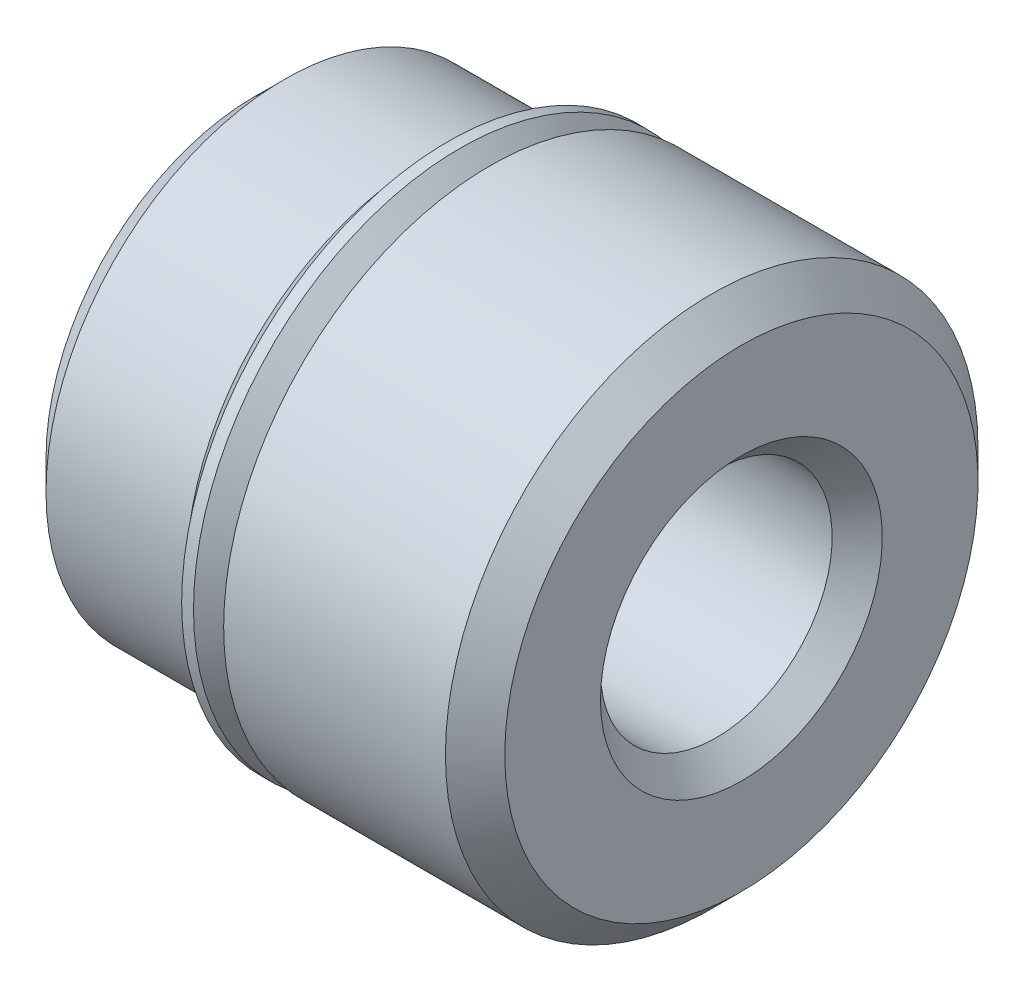
ISO-10303-21;
HEADER;
FILE_DESCRIPTION(('STEP AP214'),'2;1');
FILE_NAME('part.step','',(''),(''),'','','');
FILE_SCHEMA(('AUTOMOTIVE_DESIGN { 1 0 10303 214 1 1 1 1 }'));
ENDSEC;
DATA;
#1=APPLICATION_CONTEXT('core data for automotive mechanical design processes');
#2=APPLICATION_PROTOCOL_DEFINITION('international standard','automotive_design',2000,#1);
#3=PRODUCT_CONTEXT('',#1,'mechanical');
#4=PRODUCT('Part','Part','',(#3));
#5=PRODUCT_RELATED_PRODUCT_CATEGORY('part','',(#4));
#6=PRODUCT_DEFINITION_FORMATION('','',#4);
#7=PRODUCT_DEFINITION_CONTEXT('part definition',#1,'design');
#8=PRODUCT_DEFINITION('design','',#6,#7);
#9=PRODUCT_DEFINITION_SHAPE('','',#8);
#10=(LENGTH_UNIT() NAMED_UNIT(*) SI_UNIT(.MILLI.,.METRE.));
#11=(NAMED_UNIT(*) PLANE_ANGLE_UNIT() SI_UNIT($,.RADIAN.));
#12=(NAMED_UNIT(*) SI_UNIT($,.STERADIAN.) SOLID_ANGLE_UNIT());
#13=UNCERTAINTY_MEASURE_WITH_UNIT(LENGTH_MEASURE(1.E-05),#10,'distance_accuracy_value','');
#14=(GEOMETRIC_REPRESENTATION_CONTEXT(3) GLOBAL_UNCERTAINTY_ASSIGNED_CONTEXT((#13)) GLOBAL_UNIT_ASSIGNED_CONTEXT((#10,
#11,#12)) REPRESENTATION_CONTEXT('',''));
#15=CARTESIAN_POINT('',(0.,0.,0.));
#16=DIRECTION('',(0.,0.,1.));
#17=DIRECTION('',(1.,0.,0.));
#18=AXIS2_PLACEMENT_3D('',#15,#16,#17);
#19=CARTESIAN_POINT('',(8.3312,0.,0.));
#20=DIRECTION('',(-1.,0.,0.));
#21=DIRECTION('',(0.,0.,1.));
#22=AXIS2_PLACEMENT_3D('',#19,#20,#21);
#23=CYLINDRICAL_SURFACE('',#22,3.52425);
#24=CARTESIAN_POINT('',(3.4671,0.,0.));
#25=DIRECTION('',(-1.,0.,0.));
#26=DIRECTION('',(0.,0.,1.));
#27=AXIS2_PLACEMENT_3D('',#24,#25,#26);
#28=CIRCLE('',#27,3.52425);
#29=CARTESIAN_POINT('',(3.4671,0.,3.52425));
#30=VERTEX_POINT('',#29);
#31=EDGE_CURVE('E58',#30,#30,#28,.T.);
#32=ORIENTED_EDGE('',*,*,#31,.F.);
#33=EDGE_LOOP('',(#32));
#34=FACE_BOUND('',#33,.T.);
#35=CARTESIAN_POINT('',(3.7465000000001,0.,0.));
#36=DIRECTION('',(1.,0.,0.));
#37=DIRECTION('',(0.,0.,-1.));
#38=AXIS2_PLACEMENT_3D('',#35,#36,#37);
#39=CIRCLE('',#38,3.52425);
#40=CARTESIAN_POINT('',(3.7465000000001,0.,-3.52425));
#41=VERTEX_POINT('',#40);
#42=EDGE_CURVE('E10',#41,#41,#39,.T.);
#43=ORIENTED_EDGE('',*,*,#42,.F.);
#44=EDGE_LOOP('',(#43));
#45=FACE_BOUND('',#44,.T.);
#46=ADVANCED_FACE('F35',(#34,#45),#23,.T.);
#47=CARTESIAN_POINT('',(4.0259,3.52425,0.));
#48=DIRECTION('',(1.,0.,0.));
#49=DIRECTION('',(0.,0.,-1.));
#50=AXIS2_PLACEMENT_3D('',#47,#48,#49);
#51=PLANE('',#50);
#52=CARTESIAN_POINT('',(4.0259,0.,0.));
#53=DIRECTION('',(-1.,0.,0.));
#54=DIRECTION('',(0.,0.,1.));
#55=AXIS2_PLACEMENT_3D('',#52,#53,#54);
#56=CIRCLE('',#55,4.5593);
#57=CARTESIAN_POINT('',(4.0259,0.,4.5593));
#58=VERTEX_POINT('',#57);
#59=EDGE_CURVE('E61',#58,#58,#56,.T.);
#60=ORIENTED_EDGE('',*,*,#59,.T.);
#61=EDGE_LOOP('',(#60));
#62=FACE_BOUND('',#61,.T.);
#63=CARTESIAN_POINT('',(4.0259,0.,0.));
#64=DIRECTION('',(1.,0.,0.));
#65=DIRECTION('',(0.,0.,-1.));
#66=AXIS2_PLACEMENT_3D('',#63,#64,#65);
#67=CIRCLE('',#66,4.0430807345283);
#68=CARTESIAN_POINT('',(4.0259,0.,-4.0430807345283));
#69=VERTEX_POINT('',#68);
#70=EDGE_CURVE('E42',#69,#69,#67,.F.);
#71=ORIENTED_EDGE('',*,*,#70,.F.);
#72=EDGE_LOOP('',(#71));
#73=FACE_BOUND('',#72,.T.);
#74=ADVANCED_FACE('F123',(#62,#73),#51,.F.);
#75=CARTESIAN_POINT('',(0.,0.,0.));
#76=DIRECTION('',(1.,0.,0.));
#77=DIRECTION('',(0.,0.,-1.));
#78=AXIS2_PLACEMENT_3D('',#75,#76,#77);
#79=PLANE('',#78);
#80=CARTESIAN_POINT('',(0.,0.,0.));
#81=DIRECTION('',(-1.,0.,0.));
#82=DIRECTION('',(0.,0.,1.));
#83=AXIS2_PLACEMENT_3D('',#80,#81,#82);
#84=CIRCLE('',#83,3.57505);
#85=CARTESIAN_POINT('',(0.,0.,3.57505));
#86=VERTEX_POINT('',#85);
#87=EDGE_CURVE('E46',#86,#86,#84,.T.);
#88=ORIENTED_EDGE('',*,*,#87,.T.);
#89=EDGE_LOOP('',(#88));
#90=FACE_BOUND('',#89,.T.);
#91=CARTESIAN_POINT('',(0.,0.,0.));
#92=DIRECTION('',(-1.,0.,0.));
#93=DIRECTION('',(0.,0.,1.));
#94=AXIS2_PLACEMENT_3D('',#91,#92,#93);
#95=CIRCLE('',#94,2.413);
#96=CARTESIAN_POINT('',(0.,0.,2.413));
#97=VERTEX_POINT('',#96);
#98=EDGE_CURVE('E70',#97,#97,#95,.T.);
#99=ORIENTED_EDGE('',*,*,#98,.F.);
#100=EDGE_LOOP('',(#99));
#101=FACE_BOUND('',#100,.T.);
#102=ADVANCED_FACE('F37',(#90,#101),#79,.F.);
#103=CARTESIAN_POINT('',(8.3312,4.0513,0.));
#104=DIRECTION('',(-1.,0.,0.));
#105=DIRECTION('',(0.,0.,1.));
#106=AXIS2_PLACEMENT_3D('',#103,#104,#105);
#107=PLANE('',#106);
#108=CARTESIAN_POINT('',(8.3312,0.,0.));
#109=DIRECTION('',(-1.,0.,0.));
#110=DIRECTION('',(0.,0.,1.));
#111=AXIS2_PLACEMENT_3D('',#108,#109,#110);
#112=CIRCLE('',#111,4.0513);
#113=CARTESIAN_POINT('',(8.3312,0.,4.0513));
#114=VERTEX_POINT('',#113);
#115=EDGE_CURVE('E67',#114,#114,#112,.T.);
#116=ORIENTED_EDGE('',*,*,#115,.F.);
#117=EDGE_LOOP('',(#116));
#118=FACE_BOUND('',#117,.T.);
#119=CARTESIAN_POINT('',(8.3312,0.,0.));
#120=DIRECTION('',(-1.,0.,0.));
#121=DIRECTION('',(0.,0.,1.));
#122=AXIS2_PLACEMENT_3D('',#119,#120,#121);
#123=CIRCLE('',#122,2.413);
#124=CARTESIAN_POINT('',(8.3312,0.,2.413));
#125=VERTEX_POINT('',#124);
#126=EDGE_CURVE('E79',#125,#125,#123,.T.);
#127=ORIENTED_EDGE('',*,*,#126,.T.);
#128=EDGE_LOOP('',(#127));
#129=FACE_BOUND('',#128,.T.);
#130=ADVANCED_FACE('F145',(#118,#129),#107,.F.);
#131=CARTESIAN_POINT('',(0.508,0.,0.));
#132=DIRECTION('',(1.,0.,0.));
#133=DIRECTION('',(0.,0.,-1.));
#134=AXIS2_PLACEMENT_3D('',#131,#132,#133);
#135=CONICAL_SURFACE('',#134,4.08305,0.785398163397449);
#136=ORIENTED_EDGE('',*,*,#87,.F.);
#137=EDGE_LOOP('',(#136));
#138=FACE_BOUND('',#137,.T.);
#139=CARTESIAN_POINT('',(0.508,0.,0.));
#140=DIRECTION('',(-1.,0.,0.));
#141=DIRECTION('',(0.,0.,1.));
#142=AXIS2_PLACEMENT_3D('',#139,#140,#141);
#143=CIRCLE('',#142,4.08305);
#144=CARTESIAN_POINT('',(0.508,0.,4.08305));
#145=VERTEX_POINT('',#144);
#146=EDGE_CURVE('E50',#145,#145,#143,.T.);
#147=ORIENTED_EDGE('',*,*,#146,.T.);
#148=EDGE_LOOP('',(#147));
#149=FACE_BOUND('',#148,.T.);
#150=ADVANCED_FACE('F142',(#138,#149),#135,.T.);
#151=CARTESIAN_POINT('',(8.3312,0.,0.));
#152=DIRECTION('',(-1.,0.,0.));
#153=DIRECTION('',(0.,0.,1.));
#154=AXIS2_PLACEMENT_3D('',#151,#152,#153);
#155=CYLINDRICAL_SURFACE('',#154,4.08305);
#156=ORIENTED_EDGE('',*,*,#146,.F.);
#157=EDGE_LOOP('',(#156));
#158=FACE_BOUND('',#157,.T.);
#159=CARTESIAN_POINT('',(2.9083,0.,0.));
#160=DIRECTION('',(-1.,0.,0.));
#161=DIRECTION('',(0.,0.,1.));
#162=AXIS2_PLACEMENT_3D('',#159,#160,#161);
#163=CIRCLE('',#162,4.08305);
#164=CARTESIAN_POINT('',(2.9083,0.,4.08305));
#165=VERTEX_POINT('',#164);
#166=EDGE_CURVE('E55',#165,#165,#163,.T.);
#167=ORIENTED_EDGE('',*,*,#166,.T.);
#168=EDGE_LOOP('',(#167));
#169=FACE_BOUND('',#168,.T.);
#170=ADVANCED_FACE('F139',(#158,#169),#155,.T.);
#171=CARTESIAN_POINT('',(3.4671,0.,0.));
#172=DIRECTION('',(-1.,0.,0.));
#173=DIRECTION('',(0.,0.,1.));
#174=AXIS2_PLACEMENT_3D('',#171,#172,#173);
#175=CONICAL_SURFACE('',#174,3.52425,0.78539816339745);
#176=ORIENTED_EDGE('',*,*,#166,.F.);
#177=EDGE_LOOP('',(#176));
#178=FACE_BOUND('',#177,.T.);
#179=ORIENTED_EDGE('',*,*,#31,.T.);
#180=EDGE_LOOP('',(#179));
#181=FACE_BOUND('',#180,.T.);
#182=ADVANCED_FACE('F135',(#178,#181),#175,.T.);
#183=CARTESIAN_POINT('',(8.3312,0.,0.));
#184=DIRECTION('',(-1.,0.,0.));
#185=DIRECTION('',(0.,0.,1.));
#186=AXIS2_PLACEMENT_3D('',#183,#184,#185);
#187=CYLINDRICAL_SURFACE('',#186,4.5593);
#188=ORIENTED_EDGE('',*,*,#59,.F.);
#189=EDGE_LOOP('',(#188));
#190=FACE_BOUND('',#189,.T.);
#191=CARTESIAN_POINT('',(7.8232,0.,0.));
#192=DIRECTION('',(-1.,0.,0.));
#193=DIRECTION('',(0.,0.,1.));
#194=AXIS2_PLACEMENT_3D('',#191,#192,#193);
#195=CIRCLE('',#194,4.5593);
#196=CARTESIAN_POINT('',(7.8232,0.,4.5593));
#197=VERTEX_POINT('',#196);
#198=EDGE_CURVE('E64',#197,#197,#195,.T.);
#199=ORIENTED_EDGE('',*,*,#198,.T.);
#200=EDGE_LOOP('',(#199));
#201=FACE_BOUND('',#200,.T.);
#202=ADVANCED_FACE('F138',(#190,#201),#187,.T.);
#203=CARTESIAN_POINT('',(8.3312,0.,0.));
#204=DIRECTION('',(-1.,0.,0.));
#205=DIRECTION('',(0.,0.,1.));
#206=AXIS2_PLACEMENT_3D('',#203,#204,#205);
#207=CONICAL_SURFACE('',#206,4.0513,0.785398163397448);
#208=ORIENTED_EDGE('',*,*,#198,.F.);
#209=EDGE_LOOP('',(#208));
#210=FACE_BOUND('',#209,.T.);
#211=ORIENTED_EDGE('',*,*,#115,.T.);
#212=EDGE_LOOP('',(#211));
#213=FACE_BOUND('',#212,.T.);
#214=ADVANCED_FACE('F167',(#210,#213),#207,.T.);
#215=CARTESIAN_POINT('',(0.429260000000001,0.,0.));
#216=DIRECTION('',(-1.,0.,0.));
#217=DIRECTION('',(0.,0.,1.));
#218=AXIS2_PLACEMENT_3D('',#215,#216,#217);
#219=CONICAL_SURFACE('',#218,1.98374,0.785398163397447);
#220=ORIENTED_EDGE('',*,*,#98,.T.);
#221=EDGE_LOOP('',(#220));
#222=FACE_BOUND('',#221,.T.);
#223=CARTESIAN_POINT('',(0.429260000000001,0.,0.));
#224=DIRECTION('',(-1.,0.,0.));
#225=DIRECTION('',(0.,0.,1.));
#226=AXIS2_PLACEMENT_3D('',#223,#224,#225);
#227=CIRCLE('',#226,1.98374);
#228=CARTESIAN_POINT('',(0.429260000000001,0.,1.98374));
#229=VERTEX_POINT('',#228);
#230=EDGE_CURVE('E73',#229,#229,#227,.T.);
#231=ORIENTED_EDGE('',*,*,#230,.F.);
#232=EDGE_LOOP('',(#231));
#233=FACE_BOUND('',#232,.T.);
#234=ADVANCED_FACE('F163',(#222,#233),#219,.F.);
#235=CARTESIAN_POINT('',(8.3312,0.,0.));
#236=DIRECTION('',(-1.,0.,0.));
#237=DIRECTION('',(0.,0.,1.));
#238=AXIS2_PLACEMENT_3D('',#235,#236,#237);
#239=CYLINDRICAL_SURFACE('',#238,1.98374);
#240=ORIENTED_EDGE('',*,*,#230,.T.);
#241=EDGE_LOOP('',(#240));
#242=FACE_BOUND('',#241,.T.);
#243=CARTESIAN_POINT('',(7.90194,0.,0.));
#244=DIRECTION('',(-1.,0.,0.));
#245=DIRECTION('',(0.,0.,1.));
#246=AXIS2_PLACEMENT_3D('',#243,#244,#245);
#247=CIRCLE('',#246,1.98374);
#248=CARTESIAN_POINT('',(7.90194,0.,1.98374));
#249=VERTEX_POINT('',#248);
#250=EDGE_CURVE('E76',#249,#249,#247,.T.);
#251=ORIENTED_EDGE('',*,*,#250,.F.);
#252=EDGE_LOOP('',(#251));
#253=FACE_BOUND('',#252,.T.);
#254=ADVANCED_FACE('F166',(#242,#253),#239,.F.);
#255=CARTESIAN_POINT('',(8.3312,0.,0.));
#256=DIRECTION('',(1.,0.,0.));
#257=DIRECTION('',(0.,0.,-1.));
#258=AXIS2_PLACEMENT_3D('',#255,#256,#257);
#259=CONICAL_SURFACE('',#258,2.413,0.785398163397447);
#260=ORIENTED_EDGE('',*,*,#250,.T.);
#261=EDGE_LOOP('',(#260));
#262=FACE_BOUND('',#261,.T.);
#263=ORIENTED_EDGE('',*,*,#126,.F.);
#264=EDGE_LOOP('',(#263));
#265=FACE_BOUND('',#264,.T.);
#266=ADVANCED_FACE('F104',(#262,#265),#259,.F.);
#267=CARTESIAN_POINT('',(3.3064807345283,4.5593,0.));
#268=DIRECTION('',(1.,0.,0.));
#269=DIRECTION('',(0.,0.,-1.));
#270=AXIS2_PLACEMENT_3D('',#267,#268,#269);
#271=PLANE('',#270);
#272=CARTESIAN_POINT('',(3.3064807345283,0.,0.));
#273=DIRECTION('',(-1.,0.,0.));
#274=DIRECTION('',(0.,0.,1.));
#275=AXIS2_PLACEMENT_3D('',#272,#273,#274);
#276=CIRCLE('',#275,4.4751318041258);
#277=CARTESIAN_POINT('',(3.3064807345283,0.,4.4751318041258));
#278=VERTEX_POINT('',#277);
#279=EDGE_CURVE('E94',#278,#278,#276,.T.);
#280=ORIENTED_EDGE('',*,*,#279,.F.);
#281=EDGE_LOOP('',(#280));
#282=FACE_BOUND('',#281,.T.);
#283=CARTESIAN_POINT('',(3.3064807345283,0.,0.));
#284=DIRECTION('',(-1.,0.,0.));
#285=DIRECTION('',(0.,0.,1.));
#286=AXIS2_PLACEMENT_3D('',#283,#284,#285);
#287=CIRCLE('',#286,4.5593);
#288=CARTESIAN_POINT('',(3.3064807345283,0.,4.5593));
#289=VERTEX_POINT('',#288);
#290=EDGE_CURVE('E82',#289,#289,#287,.T.);
#291=ORIENTED_EDGE('',*,*,#290,.T.);
#292=EDGE_LOOP('',(#291));
#293=FACE_BOUND('',#292,.T.);
#294=ADVANCED_FACE('F100',(#282,#293),#271,.F.);
#295=CARTESIAN_POINT('',(4.0259,0.,0.));
#296=DIRECTION('',(-1.,0.,0.));
#297=DIRECTION('',(0.,0.,1.));
#298=AXIS2_PLACEMENT_3D('',#295,#296,#297);
#299=CYLINDRICAL_SURFACE('',#298,4.5593);
#300=ORIENTED_EDGE('',*,*,#290,.F.);
#301=EDGE_LOOP('',(#300));
#302=FACE_BOUND('',#301,.T.);
#303=CARTESIAN_POINT('',(3.5096807345283,0.,0.));
#304=DIRECTION('',(-1.,0.,0.));
#305=DIRECTION('',(0.,0.,1.));
#306=AXIS2_PLACEMENT_3D('',#303,#304,#305);
#307=CIRCLE('',#306,4.5593);
#308=CARTESIAN_POINT('',(3.5096807345283,0.,4.5593));
#309=VERTEX_POINT('',#308);
#310=EDGE_CURVE('E85',#309,#309,#307,.T.);
#311=ORIENTED_EDGE('',*,*,#310,.T.);
#312=EDGE_LOOP('',(#311));
#313=FACE_BOUND('',#312,.T.);
#314=ADVANCED_FACE('F103',(#302,#313),#299,.T.);
#315=CARTESIAN_POINT('',(4.0259,0.,0.));
#316=DIRECTION('',(-1.,0.,0.));
#317=DIRECTION('',(0.,0.,1.));
#318=AXIS2_PLACEMENT_3D('',#315,#316,#317);
#319=CONICAL_SURFACE('',#318,4.0430807345283,0.785398163397449);
#320=ORIENTED_EDGE('',*,*,#310,.F.);
#321=EDGE_LOOP('',(#320));
#322=FACE_BOUND('',#321,.T.);
#323=ORIENTED_EDGE('',*,*,#70,.T.);
#324=EDGE_LOOP('',(#323));
#325=FACE_BOUND('',#324,.T.);
#326=ADVANCED_FACE('F110',(#322,#325),#319,.T.);
#327=CARTESIAN_POINT('',(3.9121287081164,0.,0.));
#328=DIRECTION('',(1.,0.,0.));
#329=DIRECTION('',(0.,0.,-1.));
#330=AXIS2_PLACEMENT_3D('',#327,#328,#329);
#331=CONICAL_SURFACE('',#330,3.6898787081163,0.78539816339745);
#332=ORIENTED_EDGE('',*,*,#42,.T.);
#333=EDGE_LOOP('',(#332));
#334=FACE_BOUND('',#333,.T.);
#335=CARTESIAN_POINT('',(3.9121287081164,0.,0.));
#336=DIRECTION('',(-1.,0.,0.));
#337=DIRECTION('',(0.,0.,1.));
#338=AXIS2_PLACEMENT_3D('',#335,#336,#337);
#339=CIRCLE('',#338,3.6898787081163);
#340=CARTESIAN_POINT('',(3.9121287081164,0.,3.6898787081163));
#341=VERTEX_POINT('',#340);
#342=EDGE_CURVE('E88',#341,#341,#339,.T.);
#343=ORIENTED_EDGE('',*,*,#342,.T.);
#344=EDGE_LOOP('',(#343));
#345=FACE_BOUND('',#344,.T.);
#346=ADVANCED_FACE('F115',(#334,#345),#331,.T.);
#347=CARTESIAN_POINT('',(3.82232614690566,0.,0.));
#348=DIRECTION('',(-1.,0.,0.));
#349=DIRECTION('',(0.,0.,1.));
#350=AXIS2_PLACEMENT_3D('',#347,#348,#349);
#351=TOROIDAL_SURFACE('',#350,3.779681269327,0.127000000000038);
#352=ORIENTED_EDGE('',*,*,#342,.F.);
#353=EDGE_LOOP('',(#352));
#354=FACE_BOUND('',#353,.T.);
#355=CARTESIAN_POINT('',(3.9121287081164,0.,0.));
#356=DIRECTION('',(-1.,0.,0.));
#357=DIRECTION('',(0.,0.,1.));
#358=AXIS2_PLACEMENT_3D('',#355,#356,#357);
#359=CIRCLE('',#358,3.8694838305377);
#360=CARTESIAN_POINT('',(3.9121287081164,0.,3.8694838305377));
#361=VERTEX_POINT('',#360);
#362=EDGE_CURVE('E91',#361,#361,#359,.T.);
#363=ORIENTED_EDGE('',*,*,#362,.T.);
#364=EDGE_LOOP('',(#363));
#365=FACE_BOUND('',#364,.T.);
#366=ADVANCED_FACE('F120',(#354,#365),#351,.F.);
#367=CARTESIAN_POINT('',(3.3064807345283,0.,0.));
#368=DIRECTION('',(-1.,0.,0.));
#369=DIRECTION('',(0.,0.,1.));
#370=AXIS2_PLACEMENT_3D('',#367,#368,#369);
#371=CONICAL_SURFACE('',#370,4.4751318041258,0.785398163397449);
#372=ORIENTED_EDGE('',*,*,#362,.F.);
#373=EDGE_LOOP('',(#372));
#374=FACE_BOUND('',#373,.T.);
#375=ORIENTED_EDGE('',*,*,#279,.T.);
#376=EDGE_LOOP('',(#375));
#377=FACE_BOUND('',#376,.T.);
#378=ADVANCED_FACE('F98',(#374,#377),#371,.F.);
#379=CLOSED_SHELL('',(#46,#74,#102,#130,#150,#170,#182,#202,#214,#234,#254,#266,#294,#314,#326,
#346,#366,#378));
#380=MANIFOLD_SOLID_BREP('B2',#379);
#381=ADVANCED_BREP_SHAPE_REPRESENTATION('',(#18,#380),#14);
#382=SHAPE_DEFINITION_REPRESENTATION(#9,#381);
ENDSEC;
END-ISO-10303-21;
